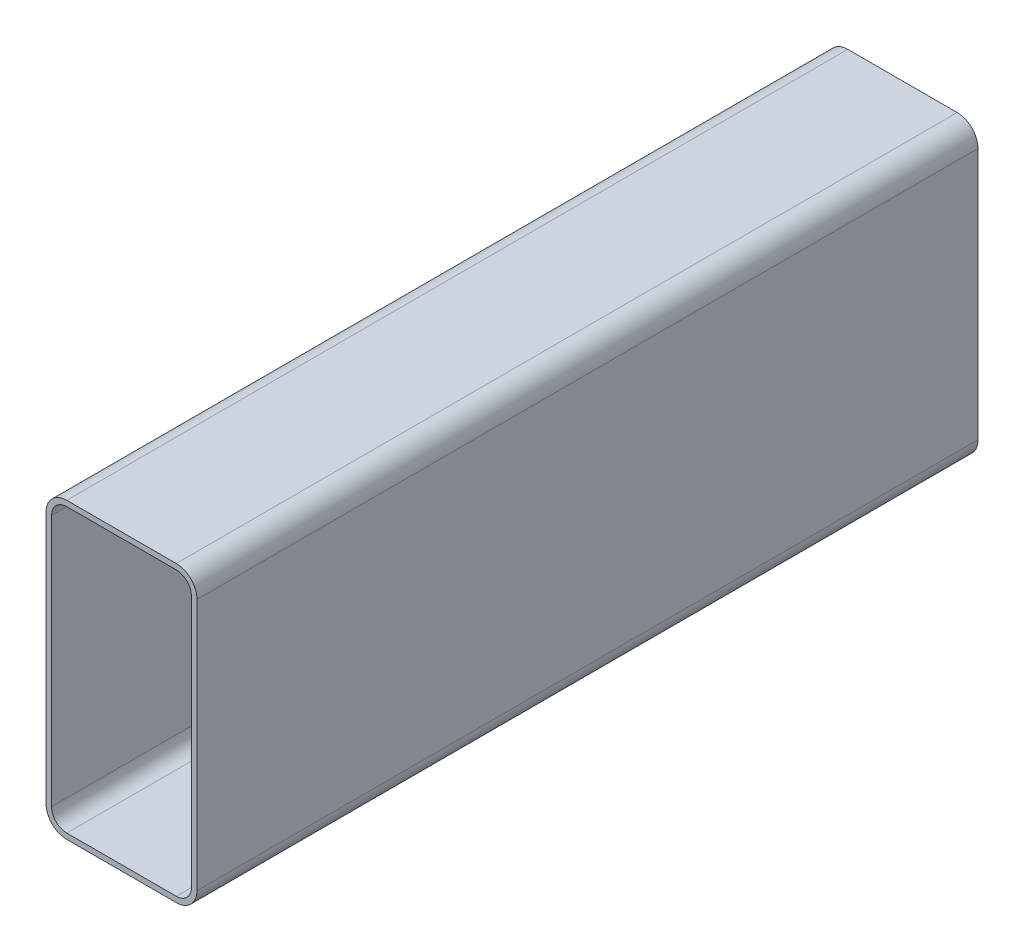
ISO-10303-21;
HEADER;
FILE_DESCRIPTION(('STEP AP214'),'2;1');
FILE_NAME('part.step','',(''),(''),'','','');
FILE_SCHEMA(('AUTOMOTIVE_DESIGN { 1 0 10303 214 1 1 1 1 }'));
ENDSEC;
DATA;
#1=APPLICATION_CONTEXT('core data for automotive mechanical design processes');
#2=APPLICATION_PROTOCOL_DEFINITION('international standard','automotive_design',2000,#1);
#3=PRODUCT_CONTEXT('',#1,'mechanical');
#4=PRODUCT('Part','Part','',(#3));
#5=PRODUCT_RELATED_PRODUCT_CATEGORY('part','',(#4));
#6=PRODUCT_DEFINITION_FORMATION('','',#4);
#7=PRODUCT_DEFINITION_CONTEXT('part definition',#1,'design');
#8=PRODUCT_DEFINITION('design','',#6,#7);
#9=PRODUCT_DEFINITION_SHAPE('','',#8);
#10=(LENGTH_UNIT() NAMED_UNIT(*) SI_UNIT(.MILLI.,.METRE.));
#11=(NAMED_UNIT(*) PLANE_ANGLE_UNIT() SI_UNIT($,.RADIAN.));
#12=(NAMED_UNIT(*) SI_UNIT($,.STERADIAN.) SOLID_ANGLE_UNIT());
#13=UNCERTAINTY_MEASURE_WITH_UNIT(LENGTH_MEASURE(1.E-05),#10,'distance_accuracy_value','');
#14=(GEOMETRIC_REPRESENTATION_CONTEXT(3) GLOBAL_UNCERTAINTY_ASSIGNED_CONTEXT((#13)) GLOBAL_UNIT_ASSIGNED_CONTEXT((#10,
#11,#12)) REPRESENTATION_CONTEXT('',''));
#15=CARTESIAN_POINT('',(0.,0.,0.));
#16=DIRECTION('',(0.,0.,1.));
#17=DIRECTION('',(1.,0.,0.));
#18=AXIS2_PLACEMENT_3D('',#15,#16,#17);
#19=CARTESIAN_POINT('',(-29.464,-57.3151,-152.4));
#20=DIRECTION('',(0.,0.,1.));
#21=DIRECTION('',(1.,0.,0.));
#22=AXIS2_PLACEMENT_3D('',#19,#20,#21);
#23=PLANE('',#22);
#24=DIRECTION('',(0.,1.,0.));
#25=VECTOR('',#24,1.);
#26=CARTESIAN_POINT('',(-27.305,0.,-152.4));
#27=LINE('',#26,#25);
#28=CARTESIAN_POINT('',(-27.305,-49.2125000005341,-152.4));
#29=VERTEX_POINT('',#28);
#30=CARTESIAN_POINT('',(-27.305,49.2124999999996,-152.4));
#31=VERTEX_POINT('',#30);
#32=EDGE_CURVE('E157',#29,#31,#27,.T.);
#33=ORIENTED_EDGE('',*,*,#32,.F.);
#34=CARTESIAN_POINT('',(-21.3614,-49.2125000000007,-152.4));
#35=DIRECTION('',(0.,0.,-1.));
#36=DIRECTION('',(0.,1.,0.));
#37=AXIS2_PLACEMENT_3D('',#34,#35,#36);
#38=CIRCLE('',#37,5.9436);
#39=CARTESIAN_POINT('',(-21.3613999988568,-55.1561,-152.4));
#40=VERTEX_POINT('',#39);
#41=EDGE_CURVE('E208',#40,#29,#38,.T.);
#42=ORIENTED_EDGE('',*,*,#41,.F.);
#43=DIRECTION('',(-1.,0.,0.));
#44=VECTOR('',#43,1.);
#45=CARTESIAN_POINT('',(0.,-55.1561,-152.4));
#46=LINE('',#45,#44);
#47=CARTESIAN_POINT('',(21.3614,-55.1561,-152.4));
#48=VERTEX_POINT('',#47);
#49=EDGE_CURVE('E153',#48,#40,#46,.T.);
#50=ORIENTED_EDGE('',*,*,#49,.F.);
#51=CARTESIAN_POINT('',(21.3614,-49.2125000000007,-152.4));
#52=DIRECTION('',(0.,0.,-1.));
#53=DIRECTION('',(0.,1.,0.));
#54=AXIS2_PLACEMENT_3D('',#51,#52,#53);
#55=CIRCLE('',#54,5.9436);
#56=CARTESIAN_POINT('',(27.305,-49.2125000012194,-152.4));
#57=VERTEX_POINT('',#56);
#58=EDGE_CURVE('E212',#57,#48,#55,.T.);
#59=ORIENTED_EDGE('',*,*,#58,.F.);
#60=DIRECTION('',(0.,-1.,0.));
#61=VECTOR('',#60,1.);
#62=CARTESIAN_POINT('',(27.305,0.,-152.4));
#63=LINE('',#62,#61);
#64=CARTESIAN_POINT('',(27.305,49.2124999999996,-152.4));
#65=VERTEX_POINT('',#64);
#66=EDGE_CURVE('E162',#65,#57,#63,.T.);
#67=ORIENTED_EDGE('',*,*,#66,.F.);
#68=CARTESIAN_POINT('',(21.3614,49.2124999999993,-152.4));
#69=DIRECTION('',(0.,0.,-1.));
#70=DIRECTION('',(0.,1.,0.));
#71=AXIS2_PLACEMENT_3D('',#68,#69,#70);
#72=CIRCLE('',#71,5.9436);
#73=CARTESIAN_POINT('',(21.3614000006095,55.1561,-152.4));
#74=VERTEX_POINT('',#73);
#75=EDGE_CURVE('E215',#74,#65,#72,.T.);
#76=ORIENTED_EDGE('',*,*,#75,.F.);
#77=DIRECTION('',(1.,0.,0.));
#78=VECTOR('',#77,1.);
#79=CARTESIAN_POINT('',(0.,55.1561,-152.4));
#80=LINE('',#79,#78);
#81=CARTESIAN_POINT('',(-21.3614,55.1561,-152.4));
#82=VERTEX_POINT('',#81);
#83=EDGE_CURVE('E167',#82,#74,#80,.T.);
#84=ORIENTED_EDGE('',*,*,#83,.F.);
#85=CARTESIAN_POINT('',(-21.3614,49.2124999999993,-152.4));
#86=DIRECTION('',(0.,0.,-1.));
#87=DIRECTION('',(0.,1.,0.));
#88=AXIS2_PLACEMENT_3D('',#85,#86,#87);
#89=CIRCLE('',#88,5.9436);
#90=EDGE_CURVE('E160',#31,#82,#89,.T.);
#91=ORIENTED_EDGE('',*,*,#90,.F.);
#92=EDGE_LOOP('',(#33,#42,#50,#59,#67,#76,#84,#91));
#93=FACE_BOUND('',#92,.T.);
#94=DIRECTION('',(0.,-1.,0.));
#95=VECTOR('',#94,1.);
#96=CARTESIAN_POINT('',(29.464,0.,-152.4));
#97=LINE('',#96,#95);
#98=CARTESIAN_POINT('',(29.464,49.2124999999997,-152.4));
#99=VERTEX_POINT('',#98);
#100=CARTESIAN_POINT('',(29.464,-49.2125000000003,-152.4));
#101=VERTEX_POINT('',#100);
#102=EDGE_CURVE('E161',#99,#101,#97,.T.);
#103=ORIENTED_EDGE('',*,*,#102,.T.);
#104=CARTESIAN_POINT('',(21.3614,-49.2125000000005,-152.4));
#105=DIRECTION('',(0.,0.,-1.));
#106=DIRECTION('',(0.,1.,0.));
#107=AXIS2_PLACEMENT_3D('',#104,#105,#106);
#108=CIRCLE('',#107,8.1026);
#109=CARTESIAN_POINT('',(21.3614000015585,-57.3151,-152.4));
#110=VERTEX_POINT('',#109);
#111=EDGE_CURVE('E220',#101,#110,#108,.T.);
#112=ORIENTED_EDGE('',*,*,#111,.T.);
#113=DIRECTION('',(-1.,0.,0.));
#114=VECTOR('',#113,1.);
#115=CARTESIAN_POINT('',(0.,-57.3151,-152.4));
#116=LINE('',#115,#114);
#117=CARTESIAN_POINT('',(-21.3614,-57.3151,-152.4));
#118=VERTEX_POINT('',#117);
#119=EDGE_CURVE('E173',#110,#118,#116,.T.);
#120=ORIENTED_EDGE('',*,*,#119,.T.);
#121=CARTESIAN_POINT('',(-21.3614,-49.2125000000005,-152.4));
#122=DIRECTION('',(0.,0.,-1.));
#123=DIRECTION('',(0.,1.,0.));
#124=AXIS2_PLACEMENT_3D('',#121,#122,#123);
#125=CIRCLE('',#124,8.1026);
#126=CARTESIAN_POINT('',(-29.464,-49.2125000007278,-152.4));
#127=VERTEX_POINT('',#126);
#128=EDGE_CURVE('E224',#118,#127,#125,.T.);
#129=ORIENTED_EDGE('',*,*,#128,.T.);
#130=DIRECTION('',(0.,1.,0.));
#131=VECTOR('',#130,1.);
#132=CARTESIAN_POINT('',(-29.464,0.,-152.4));
#133=LINE('',#132,#131);
#134=CARTESIAN_POINT('',(-29.464,49.2124999999997,-152.4));
#135=VERTEX_POINT('',#134);
#136=EDGE_CURVE('E178',#127,#135,#133,.T.);
#137=ORIENTED_EDGE('',*,*,#136,.T.);
#138=CARTESIAN_POINT('',(-21.3614,49.2124999999995,-152.4));
#139=DIRECTION('',(0.,0.,-1.));
#140=DIRECTION('',(0.,1.,0.));
#141=AXIS2_PLACEMENT_3D('',#138,#139,#140);
#142=CIRCLE('',#141,8.1026);
#143=CARTESIAN_POINT('',(-21.3613999991691,57.3151,-152.4));
#144=VERTEX_POINT('',#143);
#145=EDGE_CURVE('E140',#135,#144,#142,.T.);
#146=ORIENTED_EDGE('',*,*,#145,.T.);
#147=DIRECTION('',(1.,0.,0.));
#148=VECTOR('',#147,1.);
#149=CARTESIAN_POINT('',(0.,57.3151,-152.4));
#150=LINE('',#149,#148);
#151=CARTESIAN_POINT('',(21.3614,57.3151,-152.4));
#152=VERTEX_POINT('',#151);
#153=EDGE_CURVE('E138',#144,#152,#150,.T.);
#154=ORIENTED_EDGE('',*,*,#153,.T.);
#155=CARTESIAN_POINT('',(21.3614,49.2124999999995,-152.4));
#156=DIRECTION('',(0.,0.,-1.));
#157=DIRECTION('',(0.,1.,0.));
#158=AXIS2_PLACEMENT_3D('',#155,#156,#157);
#159=CIRCLE('',#158,8.1026);
#160=EDGE_CURVE('E19',#152,#99,#159,.T.);
#161=ORIENTED_EDGE('',*,*,#160,.T.);
#162=EDGE_LOOP('',(#103,#112,#120,#129,#137,#146,#154,#161));
#163=FACE_BOUND('',#162,.T.);
#164=ADVANCED_FACE('F15',(#93,#163),#23,.F.);
#165=CARTESIAN_POINT('',(21.3614,49.2125,152.4));
#166=DIRECTION('',(0.,0.,-1.));
#167=DIRECTION('',(0.,1.,0.));
#168=AXIS2_PLACEMENT_3D('',#165,#166,#167);
#169=CYLINDRICAL_SURFACE('',#168,8.1026);
#170=DIRECTION('',(0.,0.,1.));
#171=VECTOR('',#170,1.);
#172=CARTESIAN_POINT('',(21.3614,57.3151,0.));
#173=LINE('',#172,#171);
#174=CARTESIAN_POINT('',(21.3614,57.3151,152.4));
#175=VERTEX_POINT('',#174);
#176=EDGE_CURVE('E130',#152,#175,#173,.T.);
#177=ORIENTED_EDGE('',*,*,#176,.T.);
#178=CARTESIAN_POINT('',(21.3614,49.2125,152.4));
#179=DIRECTION('',(0.,0.,-1.));
#180=DIRECTION('',(0.,1.,0.));
#181=AXIS2_PLACEMENT_3D('',#178,#179,#180);
#182=CIRCLE('',#181,8.1026);
#183=CARTESIAN_POINT('',(29.464,49.2125,152.4));
#184=VERTEX_POINT('',#183);
#185=EDGE_CURVE('E206',#184,#175,#182,.F.);
#186=ORIENTED_EDGE('',*,*,#185,.F.);
#187=DIRECTION('',(0.,0.,-1.));
#188=VECTOR('',#187,1.);
#189=CARTESIAN_POINT('',(29.464,49.2125,0.));
#190=LINE('',#189,#188);
#191=EDGE_CURVE('E133',#184,#99,#190,.T.);
#192=ORIENTED_EDGE('',*,*,#191,.T.);
#193=ORIENTED_EDGE('',*,*,#160,.F.);
#194=EDGE_LOOP('',(#177,#186,#192,#193));
#195=FACE_BOUND('',#194,.T.);
#196=ADVANCED_FACE('F128',(#195),#169,.T.);
#197=CARTESIAN_POINT('',(-21.3614,57.3151,152.4));
#198=DIRECTION('',(0.,-1.,0.));
#199=DIRECTION('',(0.,0.,-1.));
#200=AXIS2_PLACEMENT_3D('',#197,#198,#199);
#201=PLANE('',#200);
#202=DIRECTION('',(0.,0.,-1.));
#203=VECTOR('',#202,1.);
#204=CARTESIAN_POINT('',(-21.3613999983381,57.3151,0.));
#205=LINE('',#204,#203);
#206=CARTESIAN_POINT('',(-21.3613999991691,57.3151,152.4));
#207=VERTEX_POINT('',#206);
#208=EDGE_CURVE('E143',#144,#207,#205,.F.);
#209=ORIENTED_EDGE('',*,*,#208,.T.);
#210=DIRECTION('',(-1.,0.,0.));
#211=VECTOR('',#210,1.);
#212=CARTESIAN_POINT('',(0.,57.3151,152.4));
#213=LINE('',#212,#211);
#214=EDGE_CURVE('E147',#175,#207,#213,.T.);
#215=ORIENTED_EDGE('',*,*,#214,.F.);
#216=ORIENTED_EDGE('',*,*,#176,.F.);
#217=ORIENTED_EDGE('',*,*,#153,.F.);
#218=EDGE_LOOP('',(#209,#215,#216,#217));
#219=FACE_BOUND('',#218,.T.);
#220=ADVANCED_FACE('F145',(#219),#201,.F.);
#221=CARTESIAN_POINT('',(-21.3614,49.2125,152.4));
#222=DIRECTION('',(0.,0.,-1.));
#223=DIRECTION('',(0.,1.,0.));
#224=AXIS2_PLACEMENT_3D('',#221,#222,#223);
#225=CYLINDRICAL_SURFACE('',#224,8.1026);
#226=DIRECTION('',(0.,0.,1.));
#227=VECTOR('',#226,1.);
#228=CARTESIAN_POINT('',(-29.464,49.2125,0.));
#229=LINE('',#228,#227);
#230=CARTESIAN_POINT('',(-29.464,49.2125,152.4));
#231=VERTEX_POINT('',#230);
#232=EDGE_CURVE('E180',#135,#231,#229,.T.);
#233=ORIENTED_EDGE('',*,*,#232,.T.);
#234=CARTESIAN_POINT('',(-21.3614,49.2125,152.4));
#235=DIRECTION('',(0.,0.,-1.));
#236=DIRECTION('',(0.,1.,0.));
#237=AXIS2_PLACEMENT_3D('',#234,#235,#236);
#238=CIRCLE('',#237,8.1026);
#239=EDGE_CURVE('E203',#207,#231,#238,.F.);
#240=ORIENTED_EDGE('',*,*,#239,.F.);
#241=ORIENTED_EDGE('',*,*,#208,.F.);
#242=ORIENTED_EDGE('',*,*,#145,.F.);
#243=EDGE_LOOP('',(#233,#240,#241,#242));
#244=FACE_BOUND('',#243,.T.);
#245=ADVANCED_FACE('F228',(#244),#225,.T.);
#246=CARTESIAN_POINT('',(-29.464,-49.2125,152.4));
#247=DIRECTION('',(1.,0.,0.));
#248=DIRECTION('',(0.,0.,-1.));
#249=AXIS2_PLACEMENT_3D('',#246,#247,#248);
#250=PLANE('',#249);
#251=DIRECTION('',(0.,0.,-1.));
#252=VECTOR('',#251,1.);
#253=CARTESIAN_POINT('',(-29.464,-49.2125000014551,0.));
#254=LINE('',#253,#252);
#255=CARTESIAN_POINT('',(-29.464,-49.2125000007276,152.4));
#256=VERTEX_POINT('',#255);
#257=EDGE_CURVE('E179',#127,#256,#254,.F.);
#258=ORIENTED_EDGE('',*,*,#257,.T.);
#259=DIRECTION('',(0.,-1.,0.));
#260=VECTOR('',#259,1.);
#261=CARTESIAN_POINT('',(-29.464,0.,152.4));
#262=LINE('',#261,#260);
#263=EDGE_CURVE('E202',#231,#256,#262,.T.);
#264=ORIENTED_EDGE('',*,*,#263,.F.);
#265=ORIENTED_EDGE('',*,*,#232,.F.);
#266=ORIENTED_EDGE('',*,*,#136,.F.);
#267=EDGE_LOOP('',(#258,#264,#265,#266));
#268=FACE_BOUND('',#267,.T.);
#269=ADVANCED_FACE('F260',(#268),#250,.F.);
#270=CARTESIAN_POINT('',(-21.3614,-49.2125,152.4));
#271=DIRECTION('',(0.,0.,-1.));
#272=DIRECTION('',(0.,1.,0.));
#273=AXIS2_PLACEMENT_3D('',#270,#271,#272);
#274=CYLINDRICAL_SURFACE('',#273,8.1026);
#275=DIRECTION('',(0.,0.,1.));
#276=VECTOR('',#275,1.);
#277=CARTESIAN_POINT('',(-21.3614,-57.3151,0.));
#278=LINE('',#277,#276);
#279=CARTESIAN_POINT('',(-21.3614,-57.3151,152.4));
#280=VERTEX_POINT('',#279);
#281=EDGE_CURVE('E177',#118,#280,#278,.T.);
#282=ORIENTED_EDGE('',*,*,#281,.T.);
#283=CARTESIAN_POINT('',(-21.3614,-49.2125,152.4));
#284=DIRECTION('',(0.,0.,-1.));
#285=DIRECTION('',(0.,1.,0.));
#286=AXIS2_PLACEMENT_3D('',#283,#284,#285);
#287=CIRCLE('',#286,8.1026);
#288=EDGE_CURVE('E199',#256,#280,#287,.F.);
#289=ORIENTED_EDGE('',*,*,#288,.F.);
#290=ORIENTED_EDGE('',*,*,#257,.F.);
#291=ORIENTED_EDGE('',*,*,#128,.F.);
#292=EDGE_LOOP('',(#282,#289,#290,#291));
#293=FACE_BOUND('',#292,.T.);
#294=ADVANCED_FACE('F262',(#293),#274,.T.);
#295=CARTESIAN_POINT('',(-21.3614,-57.3151,-152.4));
#296=DIRECTION('',(0.,1.,0.));
#297=DIRECTION('',(0.,0.,1.));
#298=AXIS2_PLACEMENT_3D('',#295,#296,#297);
#299=PLANE('',#298);
#300=DIRECTION('',(0.,0.,-1.));
#301=VECTOR('',#300,1.);
#302=CARTESIAN_POINT('',(21.361400003117,-57.3151,0.));
#303=LINE('',#302,#301);
#304=CARTESIAN_POINT('',(21.3614000015585,-57.3151,152.4));
#305=VERTEX_POINT('',#304);
#306=EDGE_CURVE('E176',#110,#305,#303,.F.);
#307=ORIENTED_EDGE('',*,*,#306,.T.);
#308=DIRECTION('',(1.,0.,0.));
#309=VECTOR('',#308,1.);
#310=CARTESIAN_POINT('',(0.,-57.3151,152.4));
#311=LINE('',#310,#309);
#312=EDGE_CURVE('E198',#280,#305,#311,.T.);
#313=ORIENTED_EDGE('',*,*,#312,.F.);
#314=ORIENTED_EDGE('',*,*,#281,.F.);
#315=ORIENTED_EDGE('',*,*,#119,.F.);
#316=EDGE_LOOP('',(#307,#313,#314,#315));
#317=FACE_BOUND('',#316,.T.);
#318=ADVANCED_FACE('F318',(#317),#299,.F.);
#319=CARTESIAN_POINT('',(21.3614,-49.2125,152.4));
#320=DIRECTION('',(0.,0.,-1.));
#321=DIRECTION('',(0.,1.,0.));
#322=AXIS2_PLACEMENT_3D('',#319,#320,#321);
#323=CYLINDRICAL_SURFACE('',#322,8.1026);
#324=DIRECTION('',(0.,0.,1.));
#325=VECTOR('',#324,1.);
#326=CARTESIAN_POINT('',(29.464,-49.2125,0.));
#327=LINE('',#326,#325);
#328=CARTESIAN_POINT('',(29.464,-49.2125,152.4));
#329=VERTEX_POINT('',#328);
#330=EDGE_CURVE('E223',#101,#329,#327,.T.);
#331=ORIENTED_EDGE('',*,*,#330,.T.);
#332=CARTESIAN_POINT('',(21.3614,-49.2125,152.4));
#333=DIRECTION('',(0.,0.,-1.));
#334=DIRECTION('',(0.,1.,0.));
#335=AXIS2_PLACEMENT_3D('',#332,#333,#334);
#336=CIRCLE('',#335,8.1026);
#337=EDGE_CURVE('E194',#305,#329,#336,.F.);
#338=ORIENTED_EDGE('',*,*,#337,.F.);
#339=ORIENTED_EDGE('',*,*,#306,.F.);
#340=ORIENTED_EDGE('',*,*,#111,.F.);
#341=EDGE_LOOP('',(#331,#338,#339,#340));
#342=FACE_BOUND('',#341,.T.);
#343=ADVANCED_FACE('F314',(#342),#323,.T.);
#344=CARTESIAN_POINT('',(29.464,-49.2125,-152.4));
#345=DIRECTION('',(-1.,0.,0.));
#346=DIRECTION('',(0.,0.,1.));
#347=AXIS2_PLACEMENT_3D('',#344,#345,#346);
#348=PLANE('',#347);
#349=ORIENTED_EDGE('',*,*,#191,.F.);
#350=DIRECTION('',(0.,1.,0.));
#351=VECTOR('',#350,1.);
#352=CARTESIAN_POINT('',(29.464,0.,152.4));
#353=LINE('',#352,#351);
#354=EDGE_CURVE('E197',#329,#184,#353,.T.);
#355=ORIENTED_EDGE('',*,*,#354,.F.);
#356=ORIENTED_EDGE('',*,*,#330,.F.);
#357=ORIENTED_EDGE('',*,*,#102,.F.);
#358=EDGE_LOOP('',(#349,#355,#356,#357));
#359=FACE_BOUND('',#358,.T.);
#360=ADVANCED_FACE('F317',(#359),#348,.F.);
#361=CARTESIAN_POINT('',(-27.305,-49.2125,152.4));
#362=DIRECTION('',(1.,0.,0.));
#363=DIRECTION('',(0.,0.,-1.));
#364=AXIS2_PLACEMENT_3D('',#361,#362,#363);
#365=PLANE('',#364);
#366=DIRECTION('',(0.,1.,0.));
#367=VECTOR('',#366,1.);
#368=CARTESIAN_POINT('',(-27.305000002032,0.,152.4));
#369=LINE('',#368,#367);
#370=CARTESIAN_POINT('',(-27.305000001016,-49.2125000005337,152.4));
#371=VERTEX_POINT('',#370);
#372=CARTESIAN_POINT('',(-27.305000001016,49.2125,152.4));
#373=VERTEX_POINT('',#372);
#374=EDGE_CURVE('E193',#371,#373,#369,.T.);
#375=ORIENTED_EDGE('',*,*,#374,.F.);
#376=DIRECTION('',(0.,0.,-1.));
#377=VECTOR('',#376,1.);
#378=CARTESIAN_POINT('',(-27.305,-49.2125000010674,0.));
#379=LINE('',#378,#377);
#380=EDGE_CURVE('E211',#29,#371,#379,.F.);
#381=ORIENTED_EDGE('',*,*,#380,.F.);
#382=ORIENTED_EDGE('',*,*,#32,.T.);
#383=DIRECTION('',(0.,0.,1.));
#384=VECTOR('',#383,1.);
#385=CARTESIAN_POINT('',(-27.305,49.2125,0.));
#386=LINE('',#385,#384);
#387=EDGE_CURVE('E171',#373,#31,#386,.F.);
#388=ORIENTED_EDGE('',*,*,#387,.F.);
#389=EDGE_LOOP('',(#375,#381,#382,#388));
#390=FACE_BOUND('',#389,.T.);
#391=ADVANCED_FACE('F297',(#390),#365,.T.);
#392=CARTESIAN_POINT('',(-21.3614,49.2125,152.4));
#393=DIRECTION('',(0.,0.,-1.));
#394=DIRECTION('',(0.,1.,0.));
#395=AXIS2_PLACEMENT_3D('',#392,#393,#394);
#396=CYLINDRICAL_SURFACE('',#395,5.9436);
#397=CARTESIAN_POINT('',(-21.3614,49.2125,152.4));
#398=DIRECTION('',(0.,0.,-1.));
#399=DIRECTION('',(0.,1.,0.));
#400=AXIS2_PLACEMENT_3D('',#397,#398,#399);
#401=CIRCLE('',#400,5.9436);
#402=CARTESIAN_POINT('',(-21.3614,55.1561000099822,152.4));
#403=VERTEX_POINT('',#402);
#404=EDGE_CURVE('E190',#373,#403,#401,.T.);
#405=ORIENTED_EDGE('',*,*,#404,.F.);
#406=ORIENTED_EDGE('',*,*,#387,.T.);
#407=ORIENTED_EDGE('',*,*,#90,.T.);
#408=DIRECTION('',(0.,0.,-1.));
#409=VECTOR('',#408,1.);
#410=CARTESIAN_POINT('',(-21.3614,55.1561,0.));
#411=LINE('',#410,#409);
#412=EDGE_CURVE('E170',#403,#82,#411,.T.);
#413=ORIENTED_EDGE('',*,*,#412,.F.);
#414=EDGE_LOOP('',(#405,#406,#407,#413));
#415=FACE_BOUND('',#414,.T.);
#416=ADVANCED_FACE('F294',(#415),#396,.F.);
#417=CARTESIAN_POINT('',(-21.3614,55.1561,152.4));
#418=DIRECTION('',(0.,-1.,0.));
#419=DIRECTION('',(0.,0.,-1.));
#420=AXIS2_PLACEMENT_3D('',#417,#418,#419);
#421=PLANE('',#420);
#422=DIRECTION('',(1.,0.,0.));
#423=VECTOR('',#422,1.);
#424=CARTESIAN_POINT('',(0.,55.1561000199644,152.4));
#425=LINE('',#424,#423);
#426=CARTESIAN_POINT('',(21.3614000006095,55.1561000099822,152.4));
#427=VERTEX_POINT('',#426);
#428=EDGE_CURVE('E189',#403,#427,#425,.T.);
#429=ORIENTED_EDGE('',*,*,#428,.F.);
#430=ORIENTED_EDGE('',*,*,#412,.T.);
#431=ORIENTED_EDGE('',*,*,#83,.T.);
#432=DIRECTION('',(0.,0.,1.));
#433=VECTOR('',#432,1.);
#434=CARTESIAN_POINT('',(21.3614000012191,55.1561,0.));
#435=LINE('',#434,#433);
#436=EDGE_CURVE('E166',#427,#74,#435,.F.);
#437=ORIENTED_EDGE('',*,*,#436,.F.);
#438=EDGE_LOOP('',(#429,#430,#431,#437));
#439=FACE_BOUND('',#438,.T.);
#440=ADVANCED_FACE('F291',(#439),#421,.T.);
#441=CARTESIAN_POINT('',(21.3614,49.2125,152.4));
#442=DIRECTION('',(0.,0.,-1.));
#443=DIRECTION('',(0.,1.,0.));
#444=AXIS2_PLACEMENT_3D('',#441,#442,#443);
#445=CYLINDRICAL_SURFACE('',#444,5.9436);
#446=CARTESIAN_POINT('',(21.3614,49.2125,152.4));
#447=DIRECTION('',(0.,0.,-1.));
#448=DIRECTION('',(0.,1.,0.));
#449=AXIS2_PLACEMENT_3D('',#446,#447,#448);
#450=CIRCLE('',#449,5.9436);
#451=CARTESIAN_POINT('',(27.305000001016,49.2125,152.4));
#452=VERTEX_POINT('',#451);
#453=EDGE_CURVE('E186',#427,#452,#450,.T.);
#454=ORIENTED_EDGE('',*,*,#453,.F.);
#455=ORIENTED_EDGE('',*,*,#436,.T.);
#456=ORIENTED_EDGE('',*,*,#75,.T.);
#457=DIRECTION('',(0.,0.,-1.));
#458=VECTOR('',#457,1.);
#459=CARTESIAN_POINT('',(27.305,49.2125,0.));
#460=LINE('',#459,#458);
#461=EDGE_CURVE('E165',#452,#65,#460,.T.);
#462=ORIENTED_EDGE('',*,*,#461,.F.);
#463=EDGE_LOOP('',(#454,#455,#456,#462));
#464=FACE_BOUND('',#463,.T.);
#465=ADVANCED_FACE('F288',(#464),#445,.F.);
#466=CARTESIAN_POINT('',(27.305,-49.2125,-152.4));
#467=DIRECTION('',(-1.,0.,0.));
#468=DIRECTION('',(0.,0.,1.));
#469=AXIS2_PLACEMENT_3D('',#466,#467,#468);
#470=PLANE('',#469);
#471=DIRECTION('',(0.,-1.,0.));
#472=VECTOR('',#471,1.);
#473=CARTESIAN_POINT('',(27.305000002032,0.,152.4));
#474=LINE('',#473,#472);
#475=CARTESIAN_POINT('',(27.305000001016,-49.212500001219,152.4));
#476=VERTEX_POINT('',#475);
#477=EDGE_CURVE('E185',#452,#476,#474,.T.);
#478=ORIENTED_EDGE('',*,*,#477,.F.);
#479=ORIENTED_EDGE('',*,*,#461,.T.);
#480=ORIENTED_EDGE('',*,*,#66,.T.);
#481=DIRECTION('',(0.,0.,1.));
#482=VECTOR('',#481,1.);
#483=CARTESIAN_POINT('',(27.305,-49.2125000024381,0.));
#484=LINE('',#483,#482);
#485=EDGE_CURVE('E156',#476,#57,#484,.F.);
#486=ORIENTED_EDGE('',*,*,#485,.F.);
#487=EDGE_LOOP('',(#478,#479,#480,#486));
#488=FACE_BOUND('',#487,.T.);
#489=ADVANCED_FACE('F285',(#488),#470,.T.);
#490=CARTESIAN_POINT('',(21.3614,-49.2125,152.4));
#491=DIRECTION('',(0.,0.,-1.));
#492=DIRECTION('',(0.,1.,0.));
#493=AXIS2_PLACEMENT_3D('',#490,#491,#492);
#494=CYLINDRICAL_SURFACE('',#493,5.9436);
#495=CARTESIAN_POINT('',(21.3614,-49.2125,152.4));
#496=DIRECTION('',(0.,0.,-1.));
#497=DIRECTION('',(0.,1.,0.));
#498=AXIS2_PLACEMENT_3D('',#495,#496,#497);
#499=CIRCLE('',#498,5.9436);
#500=CARTESIAN_POINT('',(21.3614,-55.1561000099822,152.4));
#501=VERTEX_POINT('',#500);
#502=EDGE_CURVE('E182',#476,#501,#499,.T.);
#503=ORIENTED_EDGE('',*,*,#502,.F.);
#504=ORIENTED_EDGE('',*,*,#485,.T.);
#505=ORIENTED_EDGE('',*,*,#58,.T.);
#506=DIRECTION('',(0.,0.,-1.));
#507=VECTOR('',#506,1.);
#508=CARTESIAN_POINT('',(21.3614,-55.1561,0.));
#509=LINE('',#508,#507);
#510=EDGE_CURVE('E155',#501,#48,#509,.T.);
#511=ORIENTED_EDGE('',*,*,#510,.F.);
#512=EDGE_LOOP('',(#503,#504,#505,#511));
#513=FACE_BOUND('',#512,.T.);
#514=ADVANCED_FACE('F281',(#513),#494,.F.);
#515=CARTESIAN_POINT('',(-21.3614,-55.1561,-152.4));
#516=DIRECTION('',(0.,1.,0.));
#517=DIRECTION('',(0.,0.,1.));
#518=AXIS2_PLACEMENT_3D('',#515,#516,#517);
#519=PLANE('',#518);
#520=DIRECTION('',(-1.,0.,0.));
#521=VECTOR('',#520,1.);
#522=CARTESIAN_POINT('',(0.,-55.1561000199644,152.4));
#523=LINE('',#522,#521);
#524=CARTESIAN_POINT('',(-21.3613999988568,-55.1561000099822,152.4));
#525=VERTEX_POINT('',#524);
#526=EDGE_CURVE('E25',#501,#525,#523,.T.);
#527=ORIENTED_EDGE('',*,*,#526,.F.);
#528=ORIENTED_EDGE('',*,*,#510,.T.);
#529=ORIENTED_EDGE('',*,*,#49,.T.);
#530=DIRECTION('',(0.,0.,1.));
#531=VECTOR('',#530,1.);
#532=CARTESIAN_POINT('',(-21.3613999977136,-55.1561,0.));
#533=LINE('',#532,#531);
#534=EDGE_CURVE('E34',#525,#40,#533,.F.);
#535=ORIENTED_EDGE('',*,*,#534,.F.);
#536=EDGE_LOOP('',(#527,#528,#529,#535));
#537=FACE_BOUND('',#536,.T.);
#538=ADVANCED_FACE('F279',(#537),#519,.T.);
#539=CARTESIAN_POINT('',(-21.3614,-49.2125,152.4));
#540=DIRECTION('',(0.,0.,-1.));
#541=DIRECTION('',(0.,1.,0.));
#542=AXIS2_PLACEMENT_3D('',#539,#540,#541);
#543=CYLINDRICAL_SURFACE('',#542,5.9436);
#544=CARTESIAN_POINT('',(-21.3614,-49.2125,152.4));
#545=DIRECTION('',(0.,0.,-1.));
#546=DIRECTION('',(0.,1.,0.));
#547=AXIS2_PLACEMENT_3D('',#544,#545,#546);
#548=CIRCLE('',#547,5.9436);
#549=EDGE_CURVE('E9',#525,#371,#548,.T.);
#550=ORIENTED_EDGE('',*,*,#549,.F.);
#551=ORIENTED_EDGE('',*,*,#534,.T.);
#552=ORIENTED_EDGE('',*,*,#41,.T.);
#553=ORIENTED_EDGE('',*,*,#380,.T.);
#554=EDGE_LOOP('',(#550,#551,#552,#553));
#555=FACE_BOUND('',#554,.T.);
#556=ADVANCED_FACE('F299',(#555),#543,.F.);
#557=CARTESIAN_POINT('',(-29.464,-57.3151,152.4));
#558=DIRECTION('',(0.,0.,1.));
#559=DIRECTION('',(1.,0.,0.));
#560=AXIS2_PLACEMENT_3D('',#557,#558,#559);
#561=PLANE('',#560);
#562=ORIENTED_EDGE('',*,*,#526,.T.);
#563=ORIENTED_EDGE('',*,*,#549,.T.);
#564=ORIENTED_EDGE('',*,*,#374,.T.);
#565=ORIENTED_EDGE('',*,*,#404,.T.);
#566=ORIENTED_EDGE('',*,*,#428,.T.);
#567=ORIENTED_EDGE('',*,*,#453,.T.);
#568=ORIENTED_EDGE('',*,*,#477,.T.);
#569=ORIENTED_EDGE('',*,*,#502,.T.);
#570=EDGE_LOOP('',(#562,#563,#564,#565,#566,#567,#568,#569));
#571=FACE_BOUND('',#570,.T.);
#572=ORIENTED_EDGE('',*,*,#337,.T.);
#573=ORIENTED_EDGE('',*,*,#354,.T.);
#574=ORIENTED_EDGE('',*,*,#185,.T.);
#575=ORIENTED_EDGE('',*,*,#214,.T.);
#576=ORIENTED_EDGE('',*,*,#239,.T.);
#577=ORIENTED_EDGE('',*,*,#263,.T.);
#578=ORIENTED_EDGE('',*,*,#288,.T.);
#579=ORIENTED_EDGE('',*,*,#312,.T.);
#580=EDGE_LOOP('',(#572,#573,#574,#575,#576,#577,#578,#579));
#581=FACE_BOUND('',#580,.T.);
#582=ADVANCED_FACE('F17',(#571,#581),#561,.T.);
#583=CLOSED_SHELL('',(#164,#196,#220,#245,#269,#294,#318,#343,#360,#391,#416,#440,#465,#489,
#514,#538,#556,#582));
#584=MANIFOLD_SOLID_BREP('B1',#583);
#585=ADVANCED_BREP_SHAPE_REPRESENTATION('',(#18,#584),#14);
#586=SHAPE_DEFINITION_REPRESENTATION(#9,#585);
ENDSEC;
END-ISO-10303-21;
